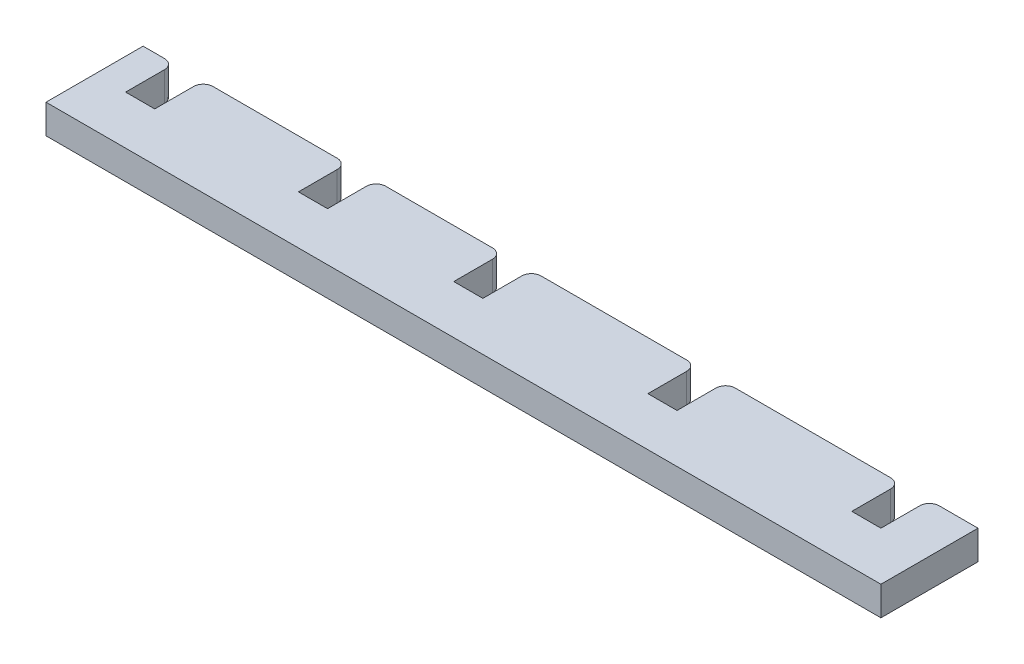
ISO-10303-21;
HEADER;
FILE_DESCRIPTION(('STEP AP214'),'2;1');
FILE_NAME('part.step','',(''),(''),'','','');
FILE_SCHEMA(('AUTOMOTIVE_DESIGN { 1 0 10303 214 1 1 1 1 }'));
ENDSEC;
DATA;
#1=APPLICATION_CONTEXT('core data for automotive mechanical design processes');
#2=APPLICATION_PROTOCOL_DEFINITION('international standard','automotive_design',2000,#1);
#3=PRODUCT_CONTEXT('',#1,'mechanical');
#4=PRODUCT('Part','Part','',(#3));
#5=PRODUCT_RELATED_PRODUCT_CATEGORY('part','',(#4));
#6=PRODUCT_DEFINITION_FORMATION('','',#4);
#7=PRODUCT_DEFINITION_CONTEXT('part definition',#1,'design');
#8=PRODUCT_DEFINITION('design','',#6,#7);
#9=PRODUCT_DEFINITION_SHAPE('','',#8);
#10=(LENGTH_UNIT() NAMED_UNIT(*) SI_UNIT(.MILLI.,.METRE.));
#11=(NAMED_UNIT(*) PLANE_ANGLE_UNIT() SI_UNIT($,.RADIAN.));
#12=(NAMED_UNIT(*) SI_UNIT($,.STERADIAN.) SOLID_ANGLE_UNIT());
#13=UNCERTAINTY_MEASURE_WITH_UNIT(LENGTH_MEASURE(1.E-05),#10,'distance_accuracy_value','');
#14=(GEOMETRIC_REPRESENTATION_CONTEXT(3) GLOBAL_UNCERTAINTY_ASSIGNED_CONTEXT((#13)) GLOBAL_UNIT_ASSIGNED_CONTEXT((#10,
#11,#12)) REPRESENTATION_CONTEXT('',''));
#15=CARTESIAN_POINT('',(0.,0.,0.));
#16=DIRECTION('',(0.,0.,1.));
#17=DIRECTION('',(1.,0.,0.));
#18=AXIS2_PLACEMENT_3D('',#15,#16,#17);
#19=CARTESIAN_POINT('',(0.,0.,0.));
#20=DIRECTION('',(0.,0.,-1.));
#21=DIRECTION('',(-1.,0.,0.));
#22=AXIS2_PLACEMENT_3D('',#19,#20,#21);
#23=PLANE('',#22);
#24=DIRECTION('',(1.,0.,0.));
#25=VECTOR('',#24,1.);
#26=CARTESIAN_POINT('',(0.,0.,0.));
#27=LINE('',#26,#25);
#28=CARTESIAN_POINT('',(82.,0.,0.));
#29=VERTEX_POINT('',#28);
#30=CARTESIAN_POINT('',(86.,0.,0.));
#31=VERTEX_POINT('',#30);
#32=EDGE_CURVE('E391',#29,#31,#27,.T.);
#33=ORIENTED_EDGE('',*,*,#32,.F.);
#34=DIRECTION('',(0.,-1.,0.));
#35=VECTOR('',#34,1.);
#36=CARTESIAN_POINT('',(82.,3.,0.));
#37=LINE('',#36,#35);
#38=CARTESIAN_POINT('',(82.,3.,0.));
#39=VERTEX_POINT('',#38);
#40=EDGE_CURVE('E11',#29,#39,#37,.F.);
#41=ORIENTED_EDGE('',*,*,#40,.T.);
#42=DIRECTION('',(-1.,0.,0.));
#43=VECTOR('',#42,1.);
#44=CARTESIAN_POINT('',(0.,3.,0.));
#45=LINE('',#44,#43);
#46=CARTESIAN_POINT('',(86.,3.,0.));
#47=VERTEX_POINT('',#46);
#48=EDGE_CURVE('E381',#47,#39,#45,.T.);
#49=ORIENTED_EDGE('',*,*,#48,.F.);
#50=DIRECTION('',(0.,1.,0.));
#51=VECTOR('',#50,1.);
#52=CARTESIAN_POINT('',(86.,0.,0.));
#53=LINE('',#52,#51);
#54=EDGE_CURVE('E395',#31,#47,#53,.T.);
#55=ORIENTED_EDGE('',*,*,#54,.F.);
#56=EDGE_LOOP('',(#33,#41,#49,#55));
#57=FACE_BOUND('',#56,.T.);
#58=ADVANCED_FACE('F35',(#57),#23,.T.);
#59=CARTESIAN_POINT('',(61.,0.,0.));
#60=VERTEX_POINT('',#59);
#61=CARTESIAN_POINT('',(77.,0.,0.));
#62=VERTEX_POINT('',#61);
#63=EDGE_CURVE('E397',#60,#62,#27,.T.);
#64=ORIENTED_EDGE('',*,*,#63,.F.);
#65=DIRECTION('',(0.,-1.,0.));
#66=VECTOR('',#65,1.);
#67=CARTESIAN_POINT('',(61.,3.,0.));
#68=LINE('',#67,#66);
#69=CARTESIAN_POINT('',(61.,3.,0.));
#70=VERTEX_POINT('',#69);
#71=EDGE_CURVE('E492',#60,#70,#68,.F.);
#72=ORIENTED_EDGE('',*,*,#71,.T.);
#73=CARTESIAN_POINT('',(77.,3.,0.));
#74=VERTEX_POINT('',#73);
#75=EDGE_CURVE('E402',#74,#70,#45,.T.);
#76=ORIENTED_EDGE('',*,*,#75,.F.);
#77=DIRECTION('',(0.,1.,0.));
#78=VECTOR('',#77,1.);
#79=CARTESIAN_POINT('',(77.,0.,0.));
#80=LINE('',#79,#78);
#81=EDGE_CURVE('E58',#74,#62,#80,.F.);
#82=ORIENTED_EDGE('',*,*,#81,.T.);
#83=EDGE_LOOP('',(#64,#72,#76,#82));
#84=FACE_BOUND('',#83,.T.);
#85=ADVANCED_FACE('F546',(#84),#23,.T.);
#86=CARTESIAN_POINT('',(41.,0.,0.));
#87=VERTEX_POINT('',#86);
#88=CARTESIAN_POINT('',(56.,0.,0.));
#89=VERTEX_POINT('',#88);
#90=EDGE_CURVE('E513',#87,#89,#27,.T.);
#91=ORIENTED_EDGE('',*,*,#90,.F.);
#92=DIRECTION('',(0.,-1.,0.));
#93=VECTOR('',#92,1.);
#94=CARTESIAN_POINT('',(41.,3.,0.));
#95=LINE('',#94,#93);
#96=CARTESIAN_POINT('',(41.,3.,0.));
#97=VERTEX_POINT('',#96);
#98=EDGE_CURVE('E483',#87,#97,#95,.F.);
#99=ORIENTED_EDGE('',*,*,#98,.T.);
#100=CARTESIAN_POINT('',(56.,3.,0.));
#101=VERTEX_POINT('',#100);
#102=EDGE_CURVE('E550',#101,#97,#45,.T.);
#103=ORIENTED_EDGE('',*,*,#102,.F.);
#104=DIRECTION('',(0.,1.,0.));
#105=VECTOR('',#104,1.);
#106=CARTESIAN_POINT('',(56.,0.,0.));
#107=LINE('',#106,#105);
#108=EDGE_CURVE('E481',#101,#89,#107,.F.);
#109=ORIENTED_EDGE('',*,*,#108,.T.);
#110=EDGE_LOOP('',(#91,#99,#103,#109));
#111=FACE_BOUND('',#110,.T.);
#112=ADVANCED_FACE('F591',(#111),#23,.T.);
#113=CARTESIAN_POINT('',(25.,0.,0.));
#114=VERTEX_POINT('',#113);
#115=CARTESIAN_POINT('',(36.,0.,0.));
#116=VERTEX_POINT('',#115);
#117=EDGE_CURVE('E515',#114,#116,#27,.T.);
#118=ORIENTED_EDGE('',*,*,#117,.F.);
#119=DIRECTION('',(0.,-1.,0.));
#120=VECTOR('',#119,1.);
#121=CARTESIAN_POINT('',(25.,3.,0.));
#122=LINE('',#121,#120);
#123=CARTESIAN_POINT('',(25.,3.,0.));
#124=VERTEX_POINT('',#123);
#125=EDGE_CURVE('E473',#114,#124,#122,.F.);
#126=ORIENTED_EDGE('',*,*,#125,.T.);
#127=CARTESIAN_POINT('',(36.,3.,0.));
#128=VERTEX_POINT('',#127);
#129=EDGE_CURVE('E551',#128,#124,#45,.T.);
#130=ORIENTED_EDGE('',*,*,#129,.F.);
#131=DIRECTION('',(0.,1.,0.));
#132=VECTOR('',#131,1.);
#133=CARTESIAN_POINT('',(36.,0.,0.));
#134=LINE('',#133,#132);
#135=EDGE_CURVE('E471',#128,#116,#134,.F.);
#136=ORIENTED_EDGE('',*,*,#135,.T.);
#137=EDGE_LOOP('',(#118,#126,#130,#136));
#138=FACE_BOUND('',#137,.T.);
#139=ADVANCED_FACE('F604',(#138),#23,.T.);
#140=CARTESIAN_POINT('',(7.19999999999998,0.,0.));
#141=VERTEX_POINT('',#140);
#142=CARTESIAN_POINT('',(20.,0.,0.));
#143=VERTEX_POINT('',#142);
#144=EDGE_CURVE('E396',#141,#143,#27,.T.);
#145=ORIENTED_EDGE('',*,*,#144,.F.);
#146=DIRECTION('',(0.,-1.,0.));
#147=VECTOR('',#146,1.);
#148=CARTESIAN_POINT('',(7.19999999999998,3.,0.));
#149=LINE('',#148,#147);
#150=CARTESIAN_POINT('',(7.19999999999998,3.,0.));
#151=VERTEX_POINT('',#150);
#152=EDGE_CURVE('E463',#141,#151,#149,.F.);
#153=ORIENTED_EDGE('',*,*,#152,.T.);
#154=CARTESIAN_POINT('',(20.,3.,0.));
#155=VERTEX_POINT('',#154);
#156=EDGE_CURVE('E554',#155,#151,#45,.T.);
#157=ORIENTED_EDGE('',*,*,#156,.F.);
#158=DIRECTION('',(0.,1.,0.));
#159=VECTOR('',#158,1.);
#160=CARTESIAN_POINT('',(20.,0.,0.));
#161=LINE('',#160,#159);
#162=EDGE_CURVE('E461',#155,#143,#161,.F.);
#163=ORIENTED_EDGE('',*,*,#162,.T.);
#164=EDGE_LOOP('',(#145,#153,#157,#163));
#165=FACE_BOUND('',#164,.T.);
#166=ADVANCED_FACE('F595',(#165),#23,.T.);
#167=CARTESIAN_POINT('',(0.,0.,10.));
#168=DIRECTION('',(1.,0.,0.));
#169=DIRECTION('',(0.,0.,-1.));
#170=AXIS2_PLACEMENT_3D('',#167,#168,#169);
#171=PLANE('',#170);
#172=DIRECTION('',(0.,-1.,0.));
#173=VECTOR('',#172,1.);
#174=CARTESIAN_POINT('',(0.,0.,0.));
#175=LINE('',#174,#173);
#176=CARTESIAN_POINT('',(0.,3.,0.));
#177=VERTEX_POINT('',#176);
#178=CARTESIAN_POINT('',(0.,0.,0.));
#179=VERTEX_POINT('',#178);
#180=EDGE_CURVE('E388',#177,#179,#175,.T.);
#181=ORIENTED_EDGE('',*,*,#180,.T.);
#182=DIRECTION('',(0.,0.,-1.));
#183=VECTOR('',#182,1.);
#184=CARTESIAN_POINT('',(0.,0.,10.));
#185=LINE('',#184,#183);
#186=CARTESIAN_POINT('',(0.,0.,10.));
#187=VERTEX_POINT('',#186);
#188=EDGE_CURVE('E411',#187,#179,#185,.T.);
#189=ORIENTED_EDGE('',*,*,#188,.F.);
#190=DIRECTION('',(0.,-1.,0.));
#191=VECTOR('',#190,1.);
#192=CARTESIAN_POINT('',(0.,0.,10.));
#193=LINE('',#192,#191);
#194=CARTESIAN_POINT('',(0.,3.,10.));
#195=VERTEX_POINT('',#194);
#196=EDGE_CURVE('E377',#195,#187,#193,.T.);
#197=ORIENTED_EDGE('',*,*,#196,.F.);
#198=DIRECTION('',(0.,0.,-1.));
#199=VECTOR('',#198,1.);
#200=CARTESIAN_POINT('',(0.,3.,10.));
#201=LINE('',#200,#199);
#202=EDGE_CURVE('E387',#195,#177,#201,.T.);
#203=ORIENTED_EDGE('',*,*,#202,.T.);
#204=EDGE_LOOP('',(#181,#189,#197,#203));
#205=FACE_BOUND('',#204,.T.);
#206=ADVANCED_FACE('F568',(#205),#171,.F.);
#207=CARTESIAN_POINT('',(0.,0.,10.));
#208=DIRECTION('',(0.,1.,0.));
#209=DIRECTION('',(0.,0.,1.));
#210=AXIS2_PLACEMENT_3D('',#207,#208,#209);
#211=PLANE('',#210);
#212=CARTESIAN_POINT('',(2.19999999999998,0.,0.));
#213=VERTEX_POINT('',#212);
#214=EDGE_CURVE('E393',#179,#213,#27,.T.);
#215=ORIENTED_EDGE('',*,*,#214,.T.);
#216=CARTESIAN_POINT('',(2.19999999999998,0.,1.));
#217=DIRECTION('',(0.,1.,0.));
#218=DIRECTION('',(0.,0.,1.));
#219=AXIS2_PLACEMENT_3D('',#216,#217,#218);
#220=CIRCLE('',#219,1.);
#221=CARTESIAN_POINT('',(3.19999999999998,0.,1.));
#222=VERTEX_POINT('',#221);
#223=EDGE_CURVE('E456',#213,#222,#220,.F.);
#224=ORIENTED_EDGE('',*,*,#223,.T.);
#225=DIRECTION('',(0.,0.,-1.));
#226=VECTOR('',#225,1.);
#227=CARTESIAN_POINT('',(3.19999999999998,0.,5.));
#228=LINE('',#227,#226);
#229=CARTESIAN_POINT('',(3.19999999999998,0.,5.));
#230=VERTEX_POINT('',#229);
#231=EDGE_CURVE('E366',#230,#222,#228,.T.);
#232=ORIENTED_EDGE('',*,*,#231,.F.);
#233=DIRECTION('',(-1.,0.,0.));
#234=VECTOR('',#233,1.);
#235=CARTESIAN_POINT('',(3.19999999999998,0.,5.));
#236=LINE('',#235,#234);
#237=CARTESIAN_POINT('',(6.19999999999998,0.,5.));
#238=VERTEX_POINT('',#237);
#239=EDGE_CURVE('E355',#238,#230,#236,.T.);
#240=ORIENTED_EDGE('',*,*,#239,.F.);
#241=DIRECTION('',(0.,0.,-1.));
#242=VECTOR('',#241,1.);
#243=CARTESIAN_POINT('',(6.19999999999998,0.,5.));
#244=LINE('',#243,#242);
#245=CARTESIAN_POINT('',(6.19999999999998,0.,1.));
#246=VERTEX_POINT('',#245);
#247=EDGE_CURVE('E336',#238,#246,#244,.T.);
#248=ORIENTED_EDGE('',*,*,#247,.T.);
#249=CARTESIAN_POINT('',(7.19999999999998,0.,1.));
#250=DIRECTION('',(0.,1.,0.));
#251=DIRECTION('',(0.,0.,1.));
#252=AXIS2_PLACEMENT_3D('',#249,#250,#251);
#253=CIRCLE('',#252,1.);
#254=EDGE_CURVE('E454',#246,#141,#253,.F.);
#255=ORIENTED_EDGE('',*,*,#254,.T.);
#256=ORIENTED_EDGE('',*,*,#144,.T.);
#257=CARTESIAN_POINT('',(20.,0.,1.));
#258=DIRECTION('',(0.,1.,0.));
#259=DIRECTION('',(0.,0.,1.));
#260=AXIS2_PLACEMENT_3D('',#257,#258,#259);
#261=CIRCLE('',#260,1.);
#262=CARTESIAN_POINT('',(21.,0.,1.));
#263=VERTEX_POINT('',#262);
#264=EDGE_CURVE('E452',#143,#263,#261,.F.);
#265=ORIENTED_EDGE('',*,*,#264,.T.);
#266=DIRECTION('',(0.,0.,-1.));
#267=VECTOR('',#266,1.);
#268=CARTESIAN_POINT('',(21.,0.,5.));
#269=LINE('',#268,#267);
#270=CARTESIAN_POINT('',(21.,0.,5.));
#271=VERTEX_POINT('',#270);
#272=EDGE_CURVE('E344',#271,#263,#269,.T.);
#273=ORIENTED_EDGE('',*,*,#272,.F.);
#274=DIRECTION('',(-1.,0.,0.));
#275=VECTOR('',#274,1.);
#276=CARTESIAN_POINT('',(21.,0.,5.));
#277=LINE('',#276,#275);
#278=CARTESIAN_POINT('',(24.,0.,5.));
#279=VERTEX_POINT('',#278);
#280=EDGE_CURVE('E332',#279,#271,#277,.T.);
#281=ORIENTED_EDGE('',*,*,#280,.F.);
#282=DIRECTION('',(0.,0.,-1.));
#283=VECTOR('',#282,1.);
#284=CARTESIAN_POINT('',(24.,0.,5.));
#285=LINE('',#284,#283);
#286=CARTESIAN_POINT('',(24.,0.,1.));
#287=VERTEX_POINT('',#286);
#288=EDGE_CURVE('E313',#279,#287,#285,.T.);
#289=ORIENTED_EDGE('',*,*,#288,.T.);
#290=CARTESIAN_POINT('',(25.,0.,1.));
#291=DIRECTION('',(0.,1.,0.));
#292=DIRECTION('',(0.,0.,1.));
#293=AXIS2_PLACEMENT_3D('',#290,#291,#292);
#294=CIRCLE('',#293,1.);
#295=EDGE_CURVE('E450',#287,#114,#294,.F.);
#296=ORIENTED_EDGE('',*,*,#295,.T.);
#297=ORIENTED_EDGE('',*,*,#117,.T.);
#298=CARTESIAN_POINT('',(36.,0.,1.));
#299=DIRECTION('',(0.,1.,0.));
#300=DIRECTION('',(0.,0.,1.));
#301=AXIS2_PLACEMENT_3D('',#298,#299,#300);
#302=CIRCLE('',#301,1.);
#303=CARTESIAN_POINT('',(37.,0.,1.));
#304=VERTEX_POINT('',#303);
#305=EDGE_CURVE('E448',#116,#304,#302,.F.);
#306=ORIENTED_EDGE('',*,*,#305,.T.);
#307=DIRECTION('',(0.,0.,-1.));
#308=VECTOR('',#307,1.);
#309=CARTESIAN_POINT('',(37.,0.,5.));
#310=LINE('',#309,#308);
#311=CARTESIAN_POINT('',(37.,0.,5.));
#312=VERTEX_POINT('',#311);
#313=EDGE_CURVE('E321',#312,#304,#310,.T.);
#314=ORIENTED_EDGE('',*,*,#313,.F.);
#315=DIRECTION('',(-1.,0.,0.));
#316=VECTOR('',#315,1.);
#317=CARTESIAN_POINT('',(37.,0.,5.));
#318=LINE('',#317,#316);
#319=CARTESIAN_POINT('',(40.,0.,5.));
#320=VERTEX_POINT('',#319);
#321=EDGE_CURVE('E309',#320,#312,#318,.T.);
#322=ORIENTED_EDGE('',*,*,#321,.F.);
#323=DIRECTION('',(0.,0.,-1.));
#324=VECTOR('',#323,1.);
#325=CARTESIAN_POINT('',(40.,0.,5.));
#326=LINE('',#325,#324);
#327=CARTESIAN_POINT('',(40.,0.,1.));
#328=VERTEX_POINT('',#327);
#329=EDGE_CURVE('E290',#320,#328,#326,.T.);
#330=ORIENTED_EDGE('',*,*,#329,.T.);
#331=CARTESIAN_POINT('',(41.,0.,1.));
#332=DIRECTION('',(0.,1.,0.));
#333=DIRECTION('',(0.,0.,1.));
#334=AXIS2_PLACEMENT_3D('',#331,#332,#333);
#335=CIRCLE('',#334,1.);
#336=EDGE_CURVE('E446',#328,#87,#335,.F.);
#337=ORIENTED_EDGE('',*,*,#336,.T.);
#338=ORIENTED_EDGE('',*,*,#90,.T.);
#339=CARTESIAN_POINT('',(56.,0.,1.));
#340=DIRECTION('',(0.,1.,0.));
#341=DIRECTION('',(0.,0.,1.));
#342=AXIS2_PLACEMENT_3D('',#339,#340,#341);
#343=CIRCLE('',#342,1.);
#344=CARTESIAN_POINT('',(57.,0.,1.));
#345=VERTEX_POINT('',#344);
#346=EDGE_CURVE('E444',#89,#345,#343,.F.);
#347=ORIENTED_EDGE('',*,*,#346,.T.);
#348=DIRECTION('',(0.,0.,-1.));
#349=VECTOR('',#348,1.);
#350=CARTESIAN_POINT('',(57.,0.,5.));
#351=LINE('',#350,#349);
#352=CARTESIAN_POINT('',(57.,0.,5.));
#353=VERTEX_POINT('',#352);
#354=EDGE_CURVE('E298',#353,#345,#351,.T.);
#355=ORIENTED_EDGE('',*,*,#354,.F.);
#356=DIRECTION('',(-1.,0.,0.));
#357=VECTOR('',#356,1.);
#358=CARTESIAN_POINT('',(57.,0.,5.));
#359=LINE('',#358,#357);
#360=CARTESIAN_POINT('',(60.,0.,5.));
#361=VERTEX_POINT('',#360);
#362=EDGE_CURVE('E286',#361,#353,#359,.T.);
#363=ORIENTED_EDGE('',*,*,#362,.F.);
#364=DIRECTION('',(0.,0.,-1.));
#365=VECTOR('',#364,1.);
#366=CARTESIAN_POINT('',(60.,0.,5.));
#367=LINE('',#366,#365);
#368=CARTESIAN_POINT('',(60.,0.,1.));
#369=VERTEX_POINT('',#368);
#370=EDGE_CURVE('E276',#361,#369,#367,.T.);
#371=ORIENTED_EDGE('',*,*,#370,.T.);
#372=CARTESIAN_POINT('',(61.,0.,1.));
#373=DIRECTION('',(0.,1.,0.));
#374=DIRECTION('',(0.,0.,1.));
#375=AXIS2_PLACEMENT_3D('',#372,#373,#374);
#376=CIRCLE('',#375,1.);
#377=EDGE_CURVE('E442',#369,#60,#376,.F.);
#378=ORIENTED_EDGE('',*,*,#377,.T.);
#379=ORIENTED_EDGE('',*,*,#63,.T.);
#380=CARTESIAN_POINT('',(77.,0.,1.));
#381=DIRECTION('',(0.,1.,0.));
#382=DIRECTION('',(0.,0.,1.));
#383=AXIS2_PLACEMENT_3D('',#380,#381,#382);
#384=CIRCLE('',#383,1.);
#385=CARTESIAN_POINT('',(78.,0.,1.));
#386=VERTEX_POINT('',#385);
#387=EDGE_CURVE('E50',#62,#386,#384,.F.);
#388=ORIENTED_EDGE('',*,*,#387,.T.);
#389=DIRECTION('',(0.,0.,-1.));
#390=VECTOR('',#389,1.);
#391=CARTESIAN_POINT('',(78.,0.,5.));
#392=LINE('',#391,#390);
#393=CARTESIAN_POINT('',(78.,0.,5.));
#394=VERTEX_POINT('',#393);
#395=EDGE_CURVE('E261',#394,#386,#392,.T.);
#396=ORIENTED_EDGE('',*,*,#395,.F.);
#397=DIRECTION('',(-1.,0.,0.));
#398=VECTOR('',#397,1.);
#399=CARTESIAN_POINT('',(78.,0.,5.));
#400=LINE('',#399,#398);
#401=CARTESIAN_POINT('',(81.,0.,5.));
#402=VERTEX_POINT('',#401);
#403=EDGE_CURVE('E268',#402,#394,#400,.T.);
#404=ORIENTED_EDGE('',*,*,#403,.F.);
#405=DIRECTION('',(0.,0.,-1.));
#406=VECTOR('',#405,1.);
#407=CARTESIAN_POINT('',(81.,0.,5.));
#408=LINE('',#407,#406);
#409=CARTESIAN_POINT('',(81.,0.,1.));
#410=VERTEX_POINT('',#409);
#411=EDGE_CURVE('E392',#402,#410,#408,.T.);
#412=ORIENTED_EDGE('',*,*,#411,.T.);
#413=CARTESIAN_POINT('',(82.,0.,1.));
#414=DIRECTION('',(0.,1.,0.));
#415=DIRECTION('',(0.,0.,1.));
#416=AXIS2_PLACEMENT_3D('',#413,#414,#415);
#417=CIRCLE('',#416,1.);
#418=EDGE_CURVE('E439',#410,#29,#417,.F.);
#419=ORIENTED_EDGE('',*,*,#418,.T.);
#420=ORIENTED_EDGE('',*,*,#32,.T.);
#421=DIRECTION('',(0.,0.,-1.));
#422=VECTOR('',#421,1.);
#423=CARTESIAN_POINT('',(86.,0.,10.));
#424=LINE('',#423,#422);
#425=CARTESIAN_POINT('',(86.,0.,10.));
#426=VERTEX_POINT('',#425);
#427=EDGE_CURVE('E408',#426,#31,#424,.T.);
#428=ORIENTED_EDGE('',*,*,#427,.F.);
#429=DIRECTION('',(1.,0.,0.));
#430=VECTOR('',#429,1.);
#431=CARTESIAN_POINT('',(0.,0.,10.));
#432=LINE('',#431,#430);
#433=EDGE_CURVE('E380',#187,#426,#432,.T.);
#434=ORIENTED_EDGE('',*,*,#433,.F.);
#435=ORIENTED_EDGE('',*,*,#188,.T.);
#436=EDGE_LOOP('',(#215,#224,#232,#240,#248,#255,#256,#265,#273,#281,#289,#296,#297,#306,#314,
#322,#330,#337,#338,#347,#355,#363,#371,#378,#379,#388,#396,#404,#412,#419,#420,#428,#434,#435));
#437=FACE_BOUND('',#436,.T.);
#438=ADVANCED_FACE('F279',(#437),#211,.F.);
#439=CARTESIAN_POINT('',(86.,0.,10.));
#440=DIRECTION('',(-1.,0.,0.));
#441=DIRECTION('',(0.,0.,1.));
#442=AXIS2_PLACEMENT_3D('',#439,#440,#441);
#443=PLANE('',#442);
#444=ORIENTED_EDGE('',*,*,#54,.T.);
#445=DIRECTION('',(0.,0.,-1.));
#446=VECTOR('',#445,1.);
#447=CARTESIAN_POINT('',(86.,3.,10.));
#448=LINE('',#447,#446);
#449=CARTESIAN_POINT('',(86.,3.,10.));
#450=VERTEX_POINT('',#449);
#451=EDGE_CURVE('E405',#450,#47,#448,.T.);
#452=ORIENTED_EDGE('',*,*,#451,.F.);
#453=DIRECTION('',(0.,1.,0.));
#454=VECTOR('',#453,1.);
#455=CARTESIAN_POINT('',(86.,0.,10.));
#456=LINE('',#455,#454);
#457=EDGE_CURVE('E383',#426,#450,#456,.T.);
#458=ORIENTED_EDGE('',*,*,#457,.F.);
#459=ORIENTED_EDGE('',*,*,#427,.T.);
#460=EDGE_LOOP('',(#444,#452,#458,#459));
#461=FACE_BOUND('',#460,.T.);
#462=ADVANCED_FACE('F577',(#461),#443,.F.);
#463=CARTESIAN_POINT('',(0.,3.,10.));
#464=DIRECTION('',(0.,-1.,0.));
#465=DIRECTION('',(0.,0.,-1.));
#466=AXIS2_PLACEMENT_3D('',#463,#464,#465);
#467=PLANE('',#466);
#468=DIRECTION('',(0.,0.,-1.));
#469=VECTOR('',#468,1.);
#470=CARTESIAN_POINT('',(3.19999999999998,3.,5.));
#471=LINE('',#470,#469);
#472=CARTESIAN_POINT('',(3.19999999999998,3.,5.));
#473=VERTEX_POINT('',#472);
#474=CARTESIAN_POINT('',(3.19999999999998,3.,1.));
#475=VERTEX_POINT('',#474);
#476=EDGE_CURVE('E372',#473,#475,#471,.T.);
#477=ORIENTED_EDGE('',*,*,#476,.T.);
#478=CARTESIAN_POINT('',(2.19999999999998,3.,1.));
#479=DIRECTION('',(0.,-1.,0.));
#480=DIRECTION('',(0.,0.,-1.));
#481=AXIS2_PLACEMENT_3D('',#478,#479,#480);
#482=CIRCLE('',#481,1.);
#483=CARTESIAN_POINT('',(2.19999999999998,3.,0.));
#484=VERTEX_POINT('',#483);
#485=EDGE_CURVE('E435',#475,#484,#482,.F.);
#486=ORIENTED_EDGE('',*,*,#485,.T.);
#487=EDGE_CURVE('E399',#484,#177,#45,.T.);
#488=ORIENTED_EDGE('',*,*,#487,.T.);
#489=ORIENTED_EDGE('',*,*,#202,.F.);
#490=DIRECTION('',(-1.,0.,0.));
#491=VECTOR('',#490,1.);
#492=CARTESIAN_POINT('',(0.,3.,10.));
#493=LINE('',#492,#491);
#494=EDGE_CURVE('E385',#450,#195,#493,.T.);
#495=ORIENTED_EDGE('',*,*,#494,.F.);
#496=ORIENTED_EDGE('',*,*,#451,.T.);
#497=ORIENTED_EDGE('',*,*,#48,.T.);
#498=CARTESIAN_POINT('',(82.,3.,1.));
#499=DIRECTION('',(0.,-1.,0.));
#500=DIRECTION('',(0.,0.,-1.));
#501=AXIS2_PLACEMENT_3D('',#498,#499,#500);
#502=CIRCLE('',#501,1.);
#503=CARTESIAN_POINT('',(81.,3.,1.));
#504=VERTEX_POINT('',#503);
#505=EDGE_CURVE('E417',#39,#504,#502,.F.);
#506=ORIENTED_EDGE('',*,*,#505,.T.);
#507=DIRECTION('',(0.,0.,-1.));
#508=VECTOR('',#507,1.);
#509=CARTESIAN_POINT('',(81.,3.,5.));
#510=LINE('',#509,#508);
#511=CARTESIAN_POINT('',(81.,3.,5.));
#512=VERTEX_POINT('',#511);
#513=EDGE_CURVE('E281',#512,#504,#510,.T.);
#514=ORIENTED_EDGE('',*,*,#513,.F.);
#515=DIRECTION('',(1.,0.,0.));
#516=VECTOR('',#515,1.);
#517=CARTESIAN_POINT('',(81.,3.,5.));
#518=LINE('',#517,#516);
#519=CARTESIAN_POINT('',(78.,3.,5.));
#520=VERTEX_POINT('',#519);
#521=EDGE_CURVE('E267',#520,#512,#518,.T.);
#522=ORIENTED_EDGE('',*,*,#521,.F.);
#523=DIRECTION('',(0.,0.,-1.));
#524=VECTOR('',#523,1.);
#525=CARTESIAN_POINT('',(78.,3.,5.));
#526=LINE('',#525,#524);
#527=CARTESIAN_POINT('',(78.,3.,1.));
#528=VERTEX_POINT('',#527);
#529=EDGE_CURVE('E264',#520,#528,#526,.T.);
#530=ORIENTED_EDGE('',*,*,#529,.T.);
#531=CARTESIAN_POINT('',(77.,3.,1.));
#532=DIRECTION('',(0.,-1.,0.));
#533=DIRECTION('',(0.,0.,-1.));
#534=AXIS2_PLACEMENT_3D('',#531,#532,#533);
#535=CIRCLE('',#534,1.);
#536=EDGE_CURVE('E419',#528,#74,#535,.F.);
#537=ORIENTED_EDGE('',*,*,#536,.T.);
#538=ORIENTED_EDGE('',*,*,#75,.T.);
#539=CARTESIAN_POINT('',(61.,3.,1.));
#540=DIRECTION('',(0.,-1.,0.));
#541=DIRECTION('',(0.,0.,-1.));
#542=AXIS2_PLACEMENT_3D('',#539,#540,#541);
#543=CIRCLE('',#542,1.);
#544=CARTESIAN_POINT('',(60.,3.,1.));
#545=VERTEX_POINT('',#544);
#546=EDGE_CURVE('E421',#70,#545,#543,.F.);
#547=ORIENTED_EDGE('',*,*,#546,.T.);
#548=DIRECTION('',(0.,0.,-1.));
#549=VECTOR('',#548,1.);
#550=CARTESIAN_POINT('',(60.,3.,5.));
#551=LINE('',#550,#549);
#552=CARTESIAN_POINT('',(60.,3.,5.));
#553=VERTEX_POINT('',#552);
#554=EDGE_CURVE('E301',#553,#545,#551,.T.);
#555=ORIENTED_EDGE('',*,*,#554,.F.);
#556=DIRECTION('',(1.,0.,0.));
#557=VECTOR('',#556,1.);
#558=CARTESIAN_POINT('',(60.,3.,5.));
#559=LINE('',#558,#557);
#560=CARTESIAN_POINT('',(57.,3.,5.));
#561=VERTEX_POINT('',#560);
#562=EDGE_CURVE('E293',#561,#553,#559,.T.);
#563=ORIENTED_EDGE('',*,*,#562,.F.);
#564=DIRECTION('',(0.,0.,-1.));
#565=VECTOR('',#564,1.);
#566=CARTESIAN_POINT('',(57.,3.,5.));
#567=LINE('',#566,#565);
#568=CARTESIAN_POINT('',(57.,3.,1.));
#569=VERTEX_POINT('',#568);
#570=EDGE_CURVE('E304',#561,#569,#567,.T.);
#571=ORIENTED_EDGE('',*,*,#570,.T.);
#572=CARTESIAN_POINT('',(56.,3.,1.));
#573=DIRECTION('',(0.,-1.,0.));
#574=DIRECTION('',(0.,0.,-1.));
#575=AXIS2_PLACEMENT_3D('',#572,#573,#574);
#576=CIRCLE('',#575,1.);
#577=EDGE_CURVE('E423',#569,#101,#576,.F.);
#578=ORIENTED_EDGE('',*,*,#577,.T.);
#579=ORIENTED_EDGE('',*,*,#102,.T.);
#580=CARTESIAN_POINT('',(41.,3.,1.));
#581=DIRECTION('',(0.,-1.,0.));
#582=DIRECTION('',(0.,0.,-1.));
#583=AXIS2_PLACEMENT_3D('',#580,#581,#582);
#584=CIRCLE('',#583,1.);
#585=CARTESIAN_POINT('',(40.,3.,1.));
#586=VERTEX_POINT('',#585);
#587=EDGE_CURVE('E425',#97,#586,#584,.F.);
#588=ORIENTED_EDGE('',*,*,#587,.T.);
#589=DIRECTION('',(0.,0.,-1.));
#590=VECTOR('',#589,1.);
#591=CARTESIAN_POINT('',(40.,3.,5.));
#592=LINE('',#591,#590);
#593=CARTESIAN_POINT('',(40.,3.,5.));
#594=VERTEX_POINT('',#593);
#595=EDGE_CURVE('E324',#594,#586,#592,.T.);
#596=ORIENTED_EDGE('',*,*,#595,.F.);
#597=DIRECTION('',(1.,0.,0.));
#598=VECTOR('',#597,1.);
#599=CARTESIAN_POINT('',(40.,3.,5.));
#600=LINE('',#599,#598);
#601=CARTESIAN_POINT('',(37.,3.,5.));
#602=VERTEX_POINT('',#601);
#603=EDGE_CURVE('E316',#602,#594,#600,.T.);
#604=ORIENTED_EDGE('',*,*,#603,.F.);
#605=DIRECTION('',(0.,0.,-1.));
#606=VECTOR('',#605,1.);
#607=CARTESIAN_POINT('',(37.,3.,5.));
#608=LINE('',#607,#606);
#609=CARTESIAN_POINT('',(37.,3.,1.));
#610=VERTEX_POINT('',#609);
#611=EDGE_CURVE('E327',#602,#610,#608,.T.);
#612=ORIENTED_EDGE('',*,*,#611,.T.);
#613=CARTESIAN_POINT('',(36.,3.,1.));
#614=DIRECTION('',(0.,-1.,0.));
#615=DIRECTION('',(0.,0.,-1.));
#616=AXIS2_PLACEMENT_3D('',#613,#614,#615);
#617=CIRCLE('',#616,1.);
#618=EDGE_CURVE('E427',#610,#128,#617,.F.);
#619=ORIENTED_EDGE('',*,*,#618,.T.);
#620=ORIENTED_EDGE('',*,*,#129,.T.);
#621=CARTESIAN_POINT('',(25.,3.,1.));
#622=DIRECTION('',(0.,-1.,0.));
#623=DIRECTION('',(0.,0.,-1.));
#624=AXIS2_PLACEMENT_3D('',#621,#622,#623);
#625=CIRCLE('',#624,1.);
#626=CARTESIAN_POINT('',(24.,3.,1.));
#627=VERTEX_POINT('',#626);
#628=EDGE_CURVE('E429',#124,#627,#625,.F.);
#629=ORIENTED_EDGE('',*,*,#628,.T.);
#630=DIRECTION('',(0.,0.,-1.));
#631=VECTOR('',#630,1.);
#632=CARTESIAN_POINT('',(24.,3.,5.));
#633=LINE('',#632,#631);
#634=CARTESIAN_POINT('',(24.,3.,5.));
#635=VERTEX_POINT('',#634);
#636=EDGE_CURVE('E347',#635,#627,#633,.T.);
#637=ORIENTED_EDGE('',*,*,#636,.F.);
#638=DIRECTION('',(1.,0.,0.));
#639=VECTOR('',#638,1.);
#640=CARTESIAN_POINT('',(24.,3.,5.));
#641=LINE('',#640,#639);
#642=CARTESIAN_POINT('',(21.,3.,5.));
#643=VERTEX_POINT('',#642);
#644=EDGE_CURVE('E339',#643,#635,#641,.T.);
#645=ORIENTED_EDGE('',*,*,#644,.F.);
#646=DIRECTION('',(0.,0.,-1.));
#647=VECTOR('',#646,1.);
#648=CARTESIAN_POINT('',(21.,3.,5.));
#649=LINE('',#648,#647);
#650=CARTESIAN_POINT('',(21.,3.,1.));
#651=VERTEX_POINT('',#650);
#652=EDGE_CURVE('E350',#643,#651,#649,.T.);
#653=ORIENTED_EDGE('',*,*,#652,.T.);
#654=CARTESIAN_POINT('',(20.,3.,1.));
#655=DIRECTION('',(0.,-1.,0.));
#656=DIRECTION('',(0.,0.,-1.));
#657=AXIS2_PLACEMENT_3D('',#654,#655,#656);
#658=CIRCLE('',#657,1.);
#659=EDGE_CURVE('E431',#651,#155,#658,.F.);
#660=ORIENTED_EDGE('',*,*,#659,.T.);
#661=ORIENTED_EDGE('',*,*,#156,.T.);
#662=CARTESIAN_POINT('',(7.19999999999998,3.,1.));
#663=DIRECTION('',(0.,-1.,0.));
#664=DIRECTION('',(0.,0.,-1.));
#665=AXIS2_PLACEMENT_3D('',#662,#663,#664);
#666=CIRCLE('',#665,1.);
#667=CARTESIAN_POINT('',(6.19999999999998,3.,1.));
#668=VERTEX_POINT('',#667);
#669=EDGE_CURVE('E433',#151,#668,#666,.F.);
#670=ORIENTED_EDGE('',*,*,#669,.T.);
#671=DIRECTION('',(0.,0.,-1.));
#672=VECTOR('',#671,1.);
#673=CARTESIAN_POINT('',(6.19999999999998,3.,5.));
#674=LINE('',#673,#672);
#675=CARTESIAN_POINT('',(6.19999999999998,3.,5.));
#676=VERTEX_POINT('',#675);
#677=EDGE_CURVE('E369',#676,#668,#674,.T.);
#678=ORIENTED_EDGE('',*,*,#677,.F.);
#679=DIRECTION('',(1.,0.,0.));
#680=VECTOR('',#679,1.);
#681=CARTESIAN_POINT('',(6.19999999999998,3.,5.));
#682=LINE('',#681,#680);
#683=EDGE_CURVE('E361',#473,#676,#682,.T.);
#684=ORIENTED_EDGE('',*,*,#683,.F.);
#685=EDGE_LOOP('',(#477,#486,#488,#489,#495,#496,#497,#506,#514,#522,#530,#537,#538,#547,#555,
#563,#571,#578,#579,#588,#596,#604,#612,#619,#620,#629,#637,#645,#653,#660,#661,#670,#678,#684));
#686=FACE_BOUND('',#685,.T.);
#687=ADVANCED_FACE('F507',(#686),#467,.F.);
#688=CARTESIAN_POINT('',(0.,0.,10.));
#689=DIRECTION('',(0.,0.,-1.));
#690=DIRECTION('',(-1.,0.,0.));
#691=AXIS2_PLACEMENT_3D('',#688,#689,#690);
#692=PLANE('',#691);
#693=ORIENTED_EDGE('',*,*,#196,.T.);
#694=ORIENTED_EDGE('',*,*,#433,.T.);
#695=ORIENTED_EDGE('',*,*,#457,.T.);
#696=ORIENTED_EDGE('',*,*,#494,.T.);
#697=EDGE_LOOP('',(#693,#694,#695,#696));
#698=FACE_BOUND('',#697,.T.);
#699=ADVANCED_FACE('F574',(#698),#692,.F.);
#700=ORIENTED_EDGE('',*,*,#487,.F.);
#701=DIRECTION('',(0.,1.,0.));
#702=VECTOR('',#701,1.);
#703=CARTESIAN_POINT('',(2.19999999999998,0.,0.));
#704=LINE('',#703,#702);
#705=EDGE_CURVE('E437',#484,#213,#704,.F.);
#706=ORIENTED_EDGE('',*,*,#705,.T.);
#707=ORIENTED_EDGE('',*,*,#214,.F.);
#708=ORIENTED_EDGE('',*,*,#180,.F.);
#709=EDGE_LOOP('',(#700,#706,#707,#708));
#710=FACE_BOUND('',#709,.T.);
#711=ADVANCED_FACE('F570',(#710),#23,.T.);
#712=CARTESIAN_POINT('',(6.19999999999998,3.,5.));
#713=DIRECTION('',(1.,0.,0.));
#714=DIRECTION('',(0.,0.,-1.));
#715=AXIS2_PLACEMENT_3D('',#712,#713,#714);
#716=PLANE('',#715);
#717=ORIENTED_EDGE('',*,*,#677,.T.);
#718=DIRECTION('',(0.,-1.,0.));
#719=VECTOR('',#718,1.);
#720=CARTESIAN_POINT('',(6.19999999999998,0.,1.));
#721=LINE('',#720,#719);
#722=EDGE_CURVE('E458',#668,#246,#721,.T.);
#723=ORIENTED_EDGE('',*,*,#722,.T.);
#724=ORIENTED_EDGE('',*,*,#247,.F.);
#725=DIRECTION('',(0.,-1.,0.));
#726=VECTOR('',#725,1.);
#727=CARTESIAN_POINT('',(6.19999999999998,3.,5.));
#728=LINE('',#727,#726);
#729=EDGE_CURVE('E363',#676,#238,#728,.T.);
#730=ORIENTED_EDGE('',*,*,#729,.F.);
#731=EDGE_LOOP('',(#717,#723,#724,#730));
#732=FACE_BOUND('',#731,.T.);
#733=ADVANCED_FACE('F594',(#732),#716,.F.);
#734=CARTESIAN_POINT('',(3.19999999999998,3.,5.));
#735=DIRECTION('',(-1.,0.,0.));
#736=DIRECTION('',(0.,-1.,0.));
#737=AXIS2_PLACEMENT_3D('',#734,#735,#736);
#738=PLANE('',#737);
#739=ORIENTED_EDGE('',*,*,#231,.T.);
#740=DIRECTION('',(0.,1.,0.));
#741=VECTOR('',#740,1.);
#742=CARTESIAN_POINT('',(3.19999999999998,3.,1.));
#743=LINE('',#742,#741);
#744=EDGE_CURVE('E414',#222,#475,#743,.T.);
#745=ORIENTED_EDGE('',*,*,#744,.T.);
#746=ORIENTED_EDGE('',*,*,#476,.F.);
#747=DIRECTION('',(0.,1.,0.));
#748=VECTOR('',#747,1.);
#749=CARTESIAN_POINT('',(3.19999999999998,3.,5.));
#750=LINE('',#749,#748);
#751=EDGE_CURVE('E358',#230,#473,#750,.T.);
#752=ORIENTED_EDGE('',*,*,#751,.F.);
#753=EDGE_LOOP('',(#739,#745,#746,#752));
#754=FACE_BOUND('',#753,.T.);
#755=ADVANCED_FACE('F600',(#754),#738,.F.);
#756=CARTESIAN_POINT('',(0.,0.,5.));
#757=DIRECTION('',(0.,0.,-1.));
#758=DIRECTION('',(-1.,0.,0.));
#759=AXIS2_PLACEMENT_3D('',#756,#757,#758);
#760=PLANE('',#759);
#761=ORIENTED_EDGE('',*,*,#239,.T.);
#762=ORIENTED_EDGE('',*,*,#751,.T.);
#763=ORIENTED_EDGE('',*,*,#683,.T.);
#764=ORIENTED_EDGE('',*,*,#729,.T.);
#765=EDGE_LOOP('',(#761,#762,#763,#764));
#766=FACE_BOUND('',#765,.T.);
#767=ADVANCED_FACE('F622',(#766),#760,.T.);
#768=CARTESIAN_POINT('',(24.,3.,5.));
#769=DIRECTION('',(1.,0.,0.));
#770=DIRECTION('',(0.,0.,-1.));
#771=AXIS2_PLACEMENT_3D('',#768,#769,#770);
#772=PLANE('',#771);
#773=ORIENTED_EDGE('',*,*,#636,.T.);
#774=DIRECTION('',(0.,-1.,0.));
#775=VECTOR('',#774,1.);
#776=CARTESIAN_POINT('',(24.,0.,1.));
#777=LINE('',#776,#775);
#778=EDGE_CURVE('E468',#627,#287,#777,.T.);
#779=ORIENTED_EDGE('',*,*,#778,.T.);
#780=ORIENTED_EDGE('',*,*,#288,.F.);
#781=DIRECTION('',(0.,-1.,0.));
#782=VECTOR('',#781,1.);
#783=CARTESIAN_POINT('',(24.,3.,5.));
#784=LINE('',#783,#782);
#785=EDGE_CURVE('E341',#635,#279,#784,.T.);
#786=ORIENTED_EDGE('',*,*,#785,.F.);
#787=EDGE_LOOP('',(#773,#779,#780,#786));
#788=FACE_BOUND('',#787,.T.);
#789=ADVANCED_FACE('F788',(#788),#772,.F.);
#790=CARTESIAN_POINT('',(21.,3.,5.));
#791=DIRECTION('',(-1.,0.,0.));
#792=DIRECTION('',(0.,-1.,0.));
#793=AXIS2_PLACEMENT_3D('',#790,#791,#792);
#794=PLANE('',#793);
#795=ORIENTED_EDGE('',*,*,#272,.T.);
#796=DIRECTION('',(0.,1.,0.));
#797=VECTOR('',#796,1.);
#798=CARTESIAN_POINT('',(21.,3.,1.));
#799=LINE('',#798,#797);
#800=EDGE_CURVE('E465',#263,#651,#799,.T.);
#801=ORIENTED_EDGE('',*,*,#800,.T.);
#802=ORIENTED_EDGE('',*,*,#652,.F.);
#803=DIRECTION('',(0.,1.,0.));
#804=VECTOR('',#803,1.);
#805=CARTESIAN_POINT('',(21.,3.,5.));
#806=LINE('',#805,#804);
#807=EDGE_CURVE('E335',#271,#643,#806,.T.);
#808=ORIENTED_EDGE('',*,*,#807,.F.);
#809=EDGE_LOOP('',(#795,#801,#802,#808));
#810=FACE_BOUND('',#809,.T.);
#811=ADVANCED_FACE('F783',(#810),#794,.F.);
#812=CARTESIAN_POINT('',(0.,0.,5.));
#813=DIRECTION('',(0.,0.,-1.));
#814=DIRECTION('',(-1.,0.,0.));
#815=AXIS2_PLACEMENT_3D('',#812,#813,#814);
#816=PLANE('',#815);
#817=ORIENTED_EDGE('',*,*,#280,.T.);
#818=ORIENTED_EDGE('',*,*,#807,.T.);
#819=ORIENTED_EDGE('',*,*,#644,.T.);
#820=ORIENTED_EDGE('',*,*,#785,.T.);
#821=EDGE_LOOP('',(#817,#818,#819,#820));
#822=FACE_BOUND('',#821,.T.);
#823=ADVANCED_FACE('F775',(#822),#816,.T.);
#824=CARTESIAN_POINT('',(40.,3.,5.));
#825=DIRECTION('',(1.,0.,0.));
#826=DIRECTION('',(0.,0.,-1.));
#827=AXIS2_PLACEMENT_3D('',#824,#825,#826);
#828=PLANE('',#827);
#829=ORIENTED_EDGE('',*,*,#595,.T.);
#830=DIRECTION('',(0.,-1.,0.));
#831=VECTOR('',#830,1.);
#832=CARTESIAN_POINT('',(40.,0.,1.));
#833=LINE('',#832,#831);
#834=EDGE_CURVE('E478',#586,#328,#833,.T.);
#835=ORIENTED_EDGE('',*,*,#834,.T.);
#836=ORIENTED_EDGE('',*,*,#329,.F.);
#837=DIRECTION('',(0.,-1.,0.));
#838=VECTOR('',#837,1.);
#839=CARTESIAN_POINT('',(40.,3.,5.));
#840=LINE('',#839,#838);
#841=EDGE_CURVE('E318',#594,#320,#840,.T.);
#842=ORIENTED_EDGE('',*,*,#841,.F.);
#843=EDGE_LOOP('',(#829,#835,#836,#842));
#844=FACE_BOUND('',#843,.T.);
#845=ADVANCED_FACE('F764',(#844),#828,.F.);
#846=CARTESIAN_POINT('',(37.,3.,5.));
#847=DIRECTION('',(-1.,0.,0.));
#848=DIRECTION('',(0.,0.,1.));
#849=AXIS2_PLACEMENT_3D('',#846,#847,#848);
#850=PLANE('',#849);
#851=ORIENTED_EDGE('',*,*,#313,.T.);
#852=DIRECTION('',(0.,1.,0.));
#853=VECTOR('',#852,1.);
#854=CARTESIAN_POINT('',(37.,3.,1.));
#855=LINE('',#854,#853);
#856=EDGE_CURVE('E475',#304,#610,#855,.T.);
#857=ORIENTED_EDGE('',*,*,#856,.T.);
#858=ORIENTED_EDGE('',*,*,#611,.F.);
#859=DIRECTION('',(0.,1.,0.));
#860=VECTOR('',#859,1.);
#861=CARTESIAN_POINT('',(37.,3.,5.));
#862=LINE('',#861,#860);
#863=EDGE_CURVE('E312',#312,#602,#862,.T.);
#864=ORIENTED_EDGE('',*,*,#863,.F.);
#865=EDGE_LOOP('',(#851,#857,#858,#864));
#866=FACE_BOUND('',#865,.T.);
#867=ADVANCED_FACE('F759',(#866),#850,.F.);
#868=CARTESIAN_POINT('',(0.,0.,5.));
#869=DIRECTION('',(0.,0.,-1.));
#870=DIRECTION('',(-1.,0.,0.));
#871=AXIS2_PLACEMENT_3D('',#868,#869,#870);
#872=PLANE('',#871);
#873=ORIENTED_EDGE('',*,*,#321,.T.);
#874=ORIENTED_EDGE('',*,*,#863,.T.);
#875=ORIENTED_EDGE('',*,*,#603,.T.);
#876=ORIENTED_EDGE('',*,*,#841,.T.);
#877=EDGE_LOOP('',(#873,#874,#875,#876));
#878=FACE_BOUND('',#877,.T.);
#879=ADVANCED_FACE('F752',(#878),#872,.T.);
#880=CARTESIAN_POINT('',(60.,3.,5.));
#881=DIRECTION('',(1.,0.,0.));
#882=DIRECTION('',(0.,0.,-1.));
#883=AXIS2_PLACEMENT_3D('',#880,#881,#882);
#884=PLANE('',#883);
#885=ORIENTED_EDGE('',*,*,#554,.T.);
#886=DIRECTION('',(0.,-1.,0.));
#887=VECTOR('',#886,1.);
#888=CARTESIAN_POINT('',(60.,0.,1.));
#889=LINE('',#888,#887);
#890=EDGE_CURVE('E488',#545,#369,#889,.T.);
#891=ORIENTED_EDGE('',*,*,#890,.T.);
#892=ORIENTED_EDGE('',*,*,#370,.F.);
#893=DIRECTION('',(0.,-1.,0.));
#894=VECTOR('',#893,1.);
#895=CARTESIAN_POINT('',(60.,3.,5.));
#896=LINE('',#895,#894);
#897=EDGE_CURVE('E295',#553,#361,#896,.T.);
#898=ORIENTED_EDGE('',*,*,#897,.F.);
#899=EDGE_LOOP('',(#885,#891,#892,#898));
#900=FACE_BOUND('',#899,.T.);
#901=ADVANCED_FACE('F542',(#900),#884,.F.);
#902=CARTESIAN_POINT('',(57.,3.,5.));
#903=DIRECTION('',(-1.,0.,0.));
#904=DIRECTION('',(0.,0.,1.));
#905=AXIS2_PLACEMENT_3D('',#902,#903,#904);
#906=PLANE('',#905);
#907=ORIENTED_EDGE('',*,*,#354,.T.);
#908=DIRECTION('',(0.,1.,0.));
#909=VECTOR('',#908,1.);
#910=CARTESIAN_POINT('',(57.,3.,1.));
#911=LINE('',#910,#909);
#912=EDGE_CURVE('E485',#345,#569,#911,.T.);
#913=ORIENTED_EDGE('',*,*,#912,.T.);
#914=ORIENTED_EDGE('',*,*,#570,.F.);
#915=DIRECTION('',(0.,1.,0.));
#916=VECTOR('',#915,1.);
#917=CARTESIAN_POINT('',(57.,3.,5.));
#918=LINE('',#917,#916);
#919=EDGE_CURVE('E289',#353,#561,#918,.T.);
#920=ORIENTED_EDGE('',*,*,#919,.F.);
#921=EDGE_LOOP('',(#907,#913,#914,#920));
#922=FACE_BOUND('',#921,.T.);
#923=ADVANCED_FACE('F532',(#922),#906,.F.);
#924=CARTESIAN_POINT('',(0.,0.,5.));
#925=DIRECTION('',(0.,0.,-1.));
#926=DIRECTION('',(-1.,0.,0.));
#927=AXIS2_PLACEMENT_3D('',#924,#925,#926);
#928=PLANE('',#927);
#929=ORIENTED_EDGE('',*,*,#362,.T.);
#930=ORIENTED_EDGE('',*,*,#919,.T.);
#931=ORIENTED_EDGE('',*,*,#562,.T.);
#932=ORIENTED_EDGE('',*,*,#897,.T.);
#933=EDGE_LOOP('',(#929,#930,#931,#932));
#934=FACE_BOUND('',#933,.T.);
#935=ADVANCED_FACE('F539',(#934),#928,.T.);
#936=CARTESIAN_POINT('',(81.,3.,5.));
#937=DIRECTION('',(1.,0.,0.));
#938=DIRECTION('',(0.,0.,-1.));
#939=AXIS2_PLACEMENT_3D('',#936,#937,#938);
#940=PLANE('',#939);
#941=ORIENTED_EDGE('',*,*,#513,.T.);
#942=DIRECTION('',(0.,-1.,0.));
#943=VECTOR('',#942,1.);
#944=CARTESIAN_POINT('',(81.,0.,1.));
#945=LINE('',#944,#943);
#946=EDGE_CURVE('E43',#504,#410,#945,.T.);
#947=ORIENTED_EDGE('',*,*,#946,.T.);
#948=ORIENTED_EDGE('',*,*,#411,.F.);
#949=DIRECTION('',(0.,-1.,0.));
#950=VECTOR('',#949,1.);
#951=CARTESIAN_POINT('',(81.,3.,5.));
#952=LINE('',#951,#950);
#953=EDGE_CURVE('E274',#512,#402,#952,.T.);
#954=ORIENTED_EDGE('',*,*,#953,.F.);
#955=EDGE_LOOP('',(#941,#947,#948,#954));
#956=FACE_BOUND('',#955,.T.);
#957=ADVANCED_FACE('F499',(#956),#940,.F.);
#958=CARTESIAN_POINT('',(78.,3.,5.));
#959=DIRECTION('',(-1.,0.,0.));
#960=DIRECTION('',(0.,0.,1.));
#961=AXIS2_PLACEMENT_3D('',#958,#959,#960);
#962=PLANE('',#961);
#963=ORIENTED_EDGE('',*,*,#395,.T.);
#964=DIRECTION('',(0.,1.,0.));
#965=VECTOR('',#964,1.);
#966=CARTESIAN_POINT('',(78.,3.,1.));
#967=LINE('',#966,#965);
#968=EDGE_CURVE('E494',#386,#528,#967,.T.);
#969=ORIENTED_EDGE('',*,*,#968,.T.);
#970=ORIENTED_EDGE('',*,*,#529,.F.);
#971=DIRECTION('',(0.,1.,0.));
#972=VECTOR('',#971,1.);
#973=CARTESIAN_POINT('',(78.,3.,5.));
#974=LINE('',#973,#972);
#975=EDGE_CURVE('E257',#394,#520,#974,.T.);
#976=ORIENTED_EDGE('',*,*,#975,.F.);
#977=EDGE_LOOP('',(#963,#969,#970,#976));
#978=FACE_BOUND('',#977,.T.);
#979=ADVANCED_FACE('F259',(#978),#962,.F.);
#980=CARTESIAN_POINT('',(0.,0.,5.));
#981=DIRECTION('',(0.,0.,-1.));
#982=DIRECTION('',(-1.,0.,0.));
#983=AXIS2_PLACEMENT_3D('',#980,#981,#982);
#984=PLANE('',#983);
#985=ORIENTED_EDGE('',*,*,#403,.T.);
#986=ORIENTED_EDGE('',*,*,#975,.T.);
#987=ORIENTED_EDGE('',*,*,#521,.T.);
#988=ORIENTED_EDGE('',*,*,#953,.T.);
#989=EDGE_LOOP('',(#985,#986,#987,#988));
#990=FACE_BOUND('',#989,.T.);
#991=ADVANCED_FACE('F272',(#990),#984,.T.);
#992=CARTESIAN_POINT('',(2.19999999999998,3.,1.));
#993=DIRECTION('',(0.,-1.,0.));
#994=DIRECTION('',(1.,0.,0.));
#995=AXIS2_PLACEMENT_3D('',#992,#993,#994);
#996=CYLINDRICAL_SURFACE('',#995,1.);
#997=ORIENTED_EDGE('',*,*,#223,.F.);
#998=ORIENTED_EDGE('',*,*,#705,.F.);
#999=ORIENTED_EDGE('',*,*,#485,.F.);
#1000=ORIENTED_EDGE('',*,*,#744,.F.);
#1001=EDGE_LOOP('',(#997,#998,#999,#1000));
#1002=FACE_BOUND('',#1001,.T.);
#1003=ADVANCED_FACE('F627',(#1002),#996,.T.);
#1004=CARTESIAN_POINT('',(7.19999999999998,3.,1.));
#1005=DIRECTION('',(0.,1.,0.));
#1006=DIRECTION('',(0.,0.,1.));
#1007=AXIS2_PLACEMENT_3D('',#1004,#1005,#1006);
#1008=CYLINDRICAL_SURFACE('',#1007,1.);
#1009=ORIENTED_EDGE('',*,*,#669,.F.);
#1010=ORIENTED_EDGE('',*,*,#152,.F.);
#1011=ORIENTED_EDGE('',*,*,#254,.F.);
#1012=ORIENTED_EDGE('',*,*,#722,.F.);
#1013=EDGE_LOOP('',(#1009,#1010,#1011,#1012));
#1014=FACE_BOUND('',#1013,.T.);
#1015=ADVANCED_FACE('F615',(#1014),#1008,.T.);
#1016=CARTESIAN_POINT('',(20.,3.,1.));
#1017=DIRECTION('',(0.,-1.,0.));
#1018=DIRECTION('',(1.,0.,0.));
#1019=AXIS2_PLACEMENT_3D('',#1016,#1017,#1018);
#1020=CYLINDRICAL_SURFACE('',#1019,1.);
#1021=ORIENTED_EDGE('',*,*,#264,.F.);
#1022=ORIENTED_EDGE('',*,*,#162,.F.);
#1023=ORIENTED_EDGE('',*,*,#659,.F.);
#1024=ORIENTED_EDGE('',*,*,#800,.F.);
#1025=EDGE_LOOP('',(#1021,#1022,#1023,#1024));
#1026=FACE_BOUND('',#1025,.T.);
#1027=ADVANCED_FACE('F634',(#1026),#1020,.T.);
#1028=CARTESIAN_POINT('',(25.,3.,1.));
#1029=DIRECTION('',(0.,1.,0.));
#1030=DIRECTION('',(0.,0.,1.));
#1031=AXIS2_PLACEMENT_3D('',#1028,#1029,#1030);
#1032=CYLINDRICAL_SURFACE('',#1031,1.);
#1033=ORIENTED_EDGE('',*,*,#628,.F.);
#1034=ORIENTED_EDGE('',*,*,#125,.F.);
#1035=ORIENTED_EDGE('',*,*,#295,.F.);
#1036=ORIENTED_EDGE('',*,*,#778,.F.);
#1037=EDGE_LOOP('',(#1033,#1034,#1035,#1036));
#1038=FACE_BOUND('',#1037,.T.);
#1039=ADVANCED_FACE('F640',(#1038),#1032,.T.);
#1040=CARTESIAN_POINT('',(36.,3.,1.));
#1041=DIRECTION('',(0.,-1.,0.));
#1042=DIRECTION('',(0.,0.,-1.));
#1043=AXIS2_PLACEMENT_3D('',#1040,#1041,#1042);
#1044=CYLINDRICAL_SURFACE('',#1043,1.);
#1045=ORIENTED_EDGE('',*,*,#305,.F.);
#1046=ORIENTED_EDGE('',*,*,#135,.F.);
#1047=ORIENTED_EDGE('',*,*,#618,.F.);
#1048=ORIENTED_EDGE('',*,*,#856,.F.);
#1049=EDGE_LOOP('',(#1045,#1046,#1047,#1048));
#1050=FACE_BOUND('',#1049,.T.);
#1051=ADVANCED_FACE('F644',(#1050),#1044,.T.);
#1052=CARTESIAN_POINT('',(41.,3.,1.));
#1053=DIRECTION('',(0.,1.,0.));
#1054=DIRECTION('',(0.,0.,1.));
#1055=AXIS2_PLACEMENT_3D('',#1052,#1053,#1054);
#1056=CYLINDRICAL_SURFACE('',#1055,1.);
#1057=ORIENTED_EDGE('',*,*,#587,.F.);
#1058=ORIENTED_EDGE('',*,*,#98,.F.);
#1059=ORIENTED_EDGE('',*,*,#336,.F.);
#1060=ORIENTED_EDGE('',*,*,#834,.F.);
#1061=EDGE_LOOP('',(#1057,#1058,#1059,#1060));
#1062=FACE_BOUND('',#1061,.T.);
#1063=ADVANCED_FACE('F648',(#1062),#1056,.T.);
#1064=CARTESIAN_POINT('',(56.,3.,1.));
#1065=DIRECTION('',(0.,-1.,0.));
#1066=DIRECTION('',(0.,0.,-1.));
#1067=AXIS2_PLACEMENT_3D('',#1064,#1065,#1066);
#1068=CYLINDRICAL_SURFACE('',#1067,1.);
#1069=ORIENTED_EDGE('',*,*,#346,.F.);
#1070=ORIENTED_EDGE('',*,*,#108,.F.);
#1071=ORIENTED_EDGE('',*,*,#577,.F.);
#1072=ORIENTED_EDGE('',*,*,#912,.F.);
#1073=EDGE_LOOP('',(#1069,#1070,#1071,#1072));
#1074=FACE_BOUND('',#1073,.T.);
#1075=ADVANCED_FACE('F530',(#1074),#1068,.T.);
#1076=CARTESIAN_POINT('',(61.,3.,1.));
#1077=DIRECTION('',(0.,1.,0.));
#1078=DIRECTION('',(0.,0.,1.));
#1079=AXIS2_PLACEMENT_3D('',#1076,#1077,#1078);
#1080=CYLINDRICAL_SURFACE('',#1079,1.);
#1081=ORIENTED_EDGE('',*,*,#546,.F.);
#1082=ORIENTED_EDGE('',*,*,#71,.F.);
#1083=ORIENTED_EDGE('',*,*,#377,.F.);
#1084=ORIENTED_EDGE('',*,*,#890,.F.);
#1085=EDGE_LOOP('',(#1081,#1082,#1083,#1084));
#1086=FACE_BOUND('',#1085,.T.);
#1087=ADVANCED_FACE('F549',(#1086),#1080,.T.);
#1088=CARTESIAN_POINT('',(77.,3.,1.));
#1089=DIRECTION('',(0.,-1.,0.));
#1090=DIRECTION('',(0.,0.,-1.));
#1091=AXIS2_PLACEMENT_3D('',#1088,#1089,#1090);
#1092=CYLINDRICAL_SURFACE('',#1091,1.);
#1093=ORIENTED_EDGE('',*,*,#387,.F.);
#1094=ORIENTED_EDGE('',*,*,#81,.F.);
#1095=ORIENTED_EDGE('',*,*,#536,.F.);
#1096=ORIENTED_EDGE('',*,*,#968,.F.);
#1097=EDGE_LOOP('',(#1093,#1094,#1095,#1096));
#1098=FACE_BOUND('',#1097,.T.);
#1099=ADVANCED_FACE('F656',(#1098),#1092,.T.);
#1100=CARTESIAN_POINT('',(82.,3.,1.));
#1101=DIRECTION('',(0.,1.,0.));
#1102=DIRECTION('',(0.,0.,1.));
#1103=AXIS2_PLACEMENT_3D('',#1100,#1101,#1102);
#1104=CYLINDRICAL_SURFACE('',#1103,1.);
#1105=ORIENTED_EDGE('',*,*,#505,.F.);
#1106=ORIENTED_EDGE('',*,*,#40,.F.);
#1107=ORIENTED_EDGE('',*,*,#418,.F.);
#1108=ORIENTED_EDGE('',*,*,#946,.F.);
#1109=EDGE_LOOP('',(#1105,#1106,#1107,#1108));
#1110=FACE_BOUND('',#1109,.T.);
#1111=ADVANCED_FACE('F37',(#1110),#1104,.T.);
#1112=CLOSED_SHELL('',(#58,#85,#112,#139,#166,#206,#438,#462,#687,#699,#711,#733,#755,#767,#789,
#811,#823,#845,#867,#879,#901,#923,#935,#957,#979,#991,#1003,#1015,#1027,#1039,#1051,#1063,
#1075,#1087,#1099,#1111));
#1113=MANIFOLD_SOLID_BREP('B2',#1112);
#1114=ADVANCED_BREP_SHAPE_REPRESENTATION('',(#18,#1113),#14);
#1115=SHAPE_DEFINITION_REPRESENTATION(#9,#1114);
ENDSEC;
END-ISO-10303-21;
